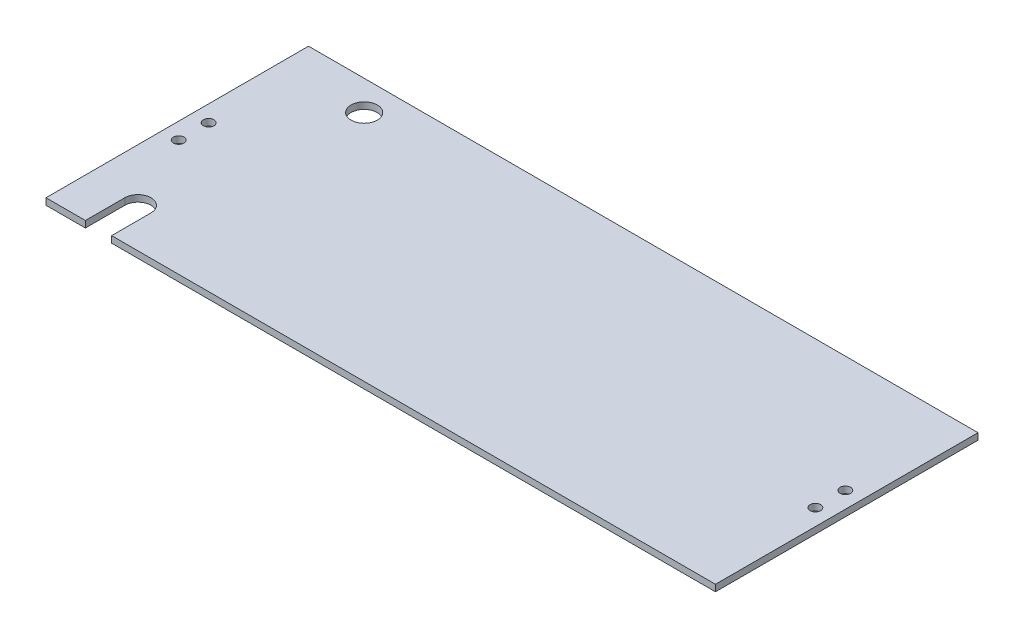
ISO-10303-21;
HEADER;
FILE_DESCRIPTION(('STEP AP214'),'2;1');
FILE_NAME('part.step','',(''),(''),'','','');
FILE_SCHEMA(('AUTOMOTIVE_DESIGN { 1 0 10303 214 1 1 1 1 }'));
ENDSEC;
DATA;
#1=APPLICATION_CONTEXT('core data for automotive mechanical design processes');
#2=APPLICATION_PROTOCOL_DEFINITION('international standard','automotive_design',2000,#1);
#3=PRODUCT_CONTEXT('',#1,'mechanical');
#4=PRODUCT('Part','Part','',(#3));
#5=PRODUCT_RELATED_PRODUCT_CATEGORY('part','',(#4));
#6=PRODUCT_DEFINITION_FORMATION('','',#4);
#7=PRODUCT_DEFINITION_CONTEXT('part definition',#1,'design');
#8=PRODUCT_DEFINITION('design','',#6,#7);
#9=PRODUCT_DEFINITION_SHAPE('','',#8);
#10=(LENGTH_UNIT() NAMED_UNIT(*) SI_UNIT(.MILLI.,.METRE.));
#11=(NAMED_UNIT(*) PLANE_ANGLE_UNIT() SI_UNIT($,.RADIAN.));
#12=(NAMED_UNIT(*) SI_UNIT($,.STERADIAN.) SOLID_ANGLE_UNIT());
#13=UNCERTAINTY_MEASURE_WITH_UNIT(LENGTH_MEASURE(1.E-05),#10,'distance_accuracy_value','');
#14=(GEOMETRIC_REPRESENTATION_CONTEXT(3) GLOBAL_UNCERTAINTY_ASSIGNED_CONTEXT((#13)) GLOBAL_UNIT_ASSIGNED_CONTEXT((#10,
#11,#12)) REPRESENTATION_CONTEXT('',''));
#15=CARTESIAN_POINT('',(0.,0.,0.));
#16=DIRECTION('',(0.,0.,1.));
#17=DIRECTION('',(1.,0.,0.));
#18=AXIS2_PLACEMENT_3D('',#15,#16,#17);
#19=CARTESIAN_POINT('',(0.,3.175,0.));
#20=DIRECTION('',(0.,0.,-1.));
#21=DIRECTION('',(-1.,0.,0.));
#22=AXIS2_PLACEMENT_3D('',#19,#20,#21);
#23=PLANE('',#22);
#24=DIRECTION('',(0.,-1.,0.));
#25=VECTOR('',#24,1.);
#26=CARTESIAN_POINT('',(19.05,3.175,0.));
#27=LINE('',#26,#25);
#28=CARTESIAN_POINT('',(19.05,3.175,0.));
#29=VERTEX_POINT('',#28);
#30=CARTESIAN_POINT('',(19.05,0.,0.));
#31=VERTEX_POINT('',#30);
#32=EDGE_CURVE('E48',#29,#31,#27,.T.);
#33=ORIENTED_EDGE('',*,*,#32,.F.);
#34=DIRECTION('',(1.,0.,0.));
#35=VECTOR('',#34,1.);
#36=CARTESIAN_POINT('',(0.,3.175,0.));
#37=LINE('',#36,#35);
#38=CARTESIAN_POINT('',(0.,3.175,0.));
#39=VERTEX_POINT('',#38);
#40=EDGE_CURVE('E84',#39,#29,#37,.T.);
#41=ORIENTED_EDGE('',*,*,#40,.F.);
#42=DIRECTION('',(0.,-1.,0.));
#43=VECTOR('',#42,1.);
#44=CARTESIAN_POINT('',(0.,3.175,0.));
#45=LINE('',#44,#43);
#46=CARTESIAN_POINT('',(0.,0.,0.));
#47=VERTEX_POINT('',#46);
#48=EDGE_CURVE('E11',#39,#47,#45,.T.);
#49=ORIENTED_EDGE('',*,*,#48,.T.);
#50=DIRECTION('',(1.,0.,0.));
#51=VECTOR('',#50,1.);
#52=CARTESIAN_POINT('',(0.,0.,0.));
#53=LINE('',#52,#51);
#54=EDGE_CURVE('E145',#47,#31,#53,.T.);
#55=ORIENTED_EDGE('',*,*,#54,.T.);
#56=EDGE_LOOP('',(#33,#41,#49,#55));
#57=FACE_BOUND('',#56,.T.);
#58=ADVANCED_FACE('F33',(#57),#23,.F.);
#59=CARTESIAN_POINT('',(0.,3.175,0.));
#60=DIRECTION('',(1.,0.,0.));
#61=DIRECTION('',(0.,0.,-1.));
#62=AXIS2_PLACEMENT_3D('',#59,#60,#61);
#63=PLANE('',#62);
#64=DIRECTION('',(0.,0.,1.));
#65=VECTOR('',#64,1.);
#66=CARTESIAN_POINT('',(0.,0.,0.));
#67=LINE('',#66,#65);
#68=CARTESIAN_POINT('',(0.,0.,-127.));
#69=VERTEX_POINT('',#68);
#70=EDGE_CURVE('E140',#69,#47,#67,.T.);
#71=ORIENTED_EDGE('',*,*,#70,.T.);
#72=ORIENTED_EDGE('',*,*,#48,.F.);
#73=DIRECTION('',(0.,0.,1.));
#74=VECTOR('',#73,1.);
#75=CARTESIAN_POINT('',(0.,3.175,0.));
#76=LINE('',#75,#74);
#77=CARTESIAN_POINT('',(0.,3.175,-127.));
#78=VERTEX_POINT('',#77);
#79=EDGE_CURVE('E131',#78,#39,#76,.T.);
#80=ORIENTED_EDGE('',*,*,#79,.F.);
#81=DIRECTION('',(0.,-1.,0.));
#82=VECTOR('',#81,1.);
#83=CARTESIAN_POINT('',(0.,3.175,-127.));
#84=LINE('',#83,#82);
#85=EDGE_CURVE('E139',#78,#69,#84,.T.);
#86=ORIENTED_EDGE('',*,*,#85,.T.);
#87=EDGE_LOOP('',(#71,#72,#80,#86));
#88=FACE_BOUND('',#87,.T.);
#89=ADVANCED_FACE('F35',(#88),#63,.F.);
#90=CARTESIAN_POINT('',(31.75,3.175,0.));
#91=VERTEX_POINT('',#90);
#92=CARTESIAN_POINT('',(323.85,3.175,0.));
#93=VERTEX_POINT('',#92);
#94=EDGE_CURVE('E121',#91,#93,#37,.T.);
#95=ORIENTED_EDGE('',*,*,#94,.F.);
#96=DIRECTION('',(0.,-1.,0.));
#97=VECTOR('',#96,1.);
#98=CARTESIAN_POINT('',(31.75,3.175,0.));
#99=LINE('',#98,#97);
#100=CARTESIAN_POINT('',(31.75,0.,0.));
#101=VERTEX_POINT('',#100);
#102=EDGE_CURVE('E108',#91,#101,#99,.T.);
#103=ORIENTED_EDGE('',*,*,#102,.T.);
#104=CARTESIAN_POINT('',(323.85,0.,0.));
#105=VERTEX_POINT('',#104);
#106=EDGE_CURVE('E143',#101,#105,#53,.T.);
#107=ORIENTED_EDGE('',*,*,#106,.T.);
#108=DIRECTION('',(0.,-1.,0.));
#109=VECTOR('',#108,1.);
#110=CARTESIAN_POINT('',(323.85,3.175,0.));
#111=LINE('',#110,#109);
#112=EDGE_CURVE('E41',#93,#105,#111,.T.);
#113=ORIENTED_EDGE('',*,*,#112,.F.);
#114=EDGE_LOOP('',(#95,#103,#107,#113));
#115=FACE_BOUND('',#114,.T.);
#116=ADVANCED_FACE('F128',(#115),#23,.F.);
#117=CARTESIAN_POINT('',(323.85,3.175,0.));
#118=DIRECTION('',(-1.,0.,0.));
#119=DIRECTION('',(0.,0.,1.));
#120=AXIS2_PLACEMENT_3D('',#117,#118,#119);
#121=PLANE('',#120);
#122=DIRECTION('',(0.,0.,-1.));
#123=VECTOR('',#122,1.);
#124=CARTESIAN_POINT('',(323.85,0.,0.));
#125=LINE('',#124,#123);
#126=CARTESIAN_POINT('',(323.85,0.,-127.));
#127=VERTEX_POINT('',#126);
#128=EDGE_CURVE('E148',#105,#127,#125,.T.);
#129=ORIENTED_EDGE('',*,*,#128,.T.);
#130=DIRECTION('',(0.,-1.,0.));
#131=VECTOR('',#130,1.);
#132=CARTESIAN_POINT('',(323.85,3.175,-127.));
#133=LINE('',#132,#131);
#134=CARTESIAN_POINT('',(323.85,3.175,-127.));
#135=VERTEX_POINT('',#134);
#136=EDGE_CURVE('E152',#135,#127,#133,.T.);
#137=ORIENTED_EDGE('',*,*,#136,.F.);
#138=DIRECTION('',(0.,0.,-1.));
#139=VECTOR('',#138,1.);
#140=CARTESIAN_POINT('',(323.85,3.175,0.));
#141=LINE('',#140,#139);
#142=EDGE_CURVE('E133',#93,#135,#141,.T.);
#143=ORIENTED_EDGE('',*,*,#142,.F.);
#144=ORIENTED_EDGE('',*,*,#112,.T.);
#145=EDGE_LOOP('',(#129,#137,#143,#144));
#146=FACE_BOUND('',#145,.T.);
#147=ADVANCED_FACE('F155',(#146),#121,.F.);
#148=CARTESIAN_POINT('',(0.,3.175,-127.));
#149=DIRECTION('',(0.,0.,1.));
#150=DIRECTION('',(1.,0.,0.));
#151=AXIS2_PLACEMENT_3D('',#148,#149,#150);
#152=PLANE('',#151);
#153=DIRECTION('',(-1.,0.,0.));
#154=VECTOR('',#153,1.);
#155=CARTESIAN_POINT('',(0.,0.,-127.));
#156=LINE('',#155,#154);
#157=EDGE_CURVE('E78',#127,#69,#156,.T.);
#158=ORIENTED_EDGE('',*,*,#157,.T.);
#159=ORIENTED_EDGE('',*,*,#85,.F.);
#160=DIRECTION('',(-1.,0.,0.));
#161=VECTOR('',#160,1.);
#162=CARTESIAN_POINT('',(0.,3.175,-127.));
#163=LINE('',#162,#161);
#164=EDGE_CURVE('E57',#135,#78,#163,.T.);
#165=ORIENTED_EDGE('',*,*,#164,.F.);
#166=ORIENTED_EDGE('',*,*,#136,.T.);
#167=EDGE_LOOP('',(#158,#159,#165,#166));
#168=FACE_BOUND('',#167,.T.);
#169=ADVANCED_FACE('F164',(#168),#152,.F.);
#170=CARTESIAN_POINT('',(0.,3.175,0.));
#171=DIRECTION('',(0.,-1.,0.));
#172=DIRECTION('',(0.,0.,-1.));
#173=AXIS2_PLACEMENT_3D('',#170,#171,#172);
#174=PLANE('',#173);
#175=CARTESIAN_POINT('',(315.9125,3.175,-70.7500000000001));
#176=DIRECTION('',(0.,-1.,0.));
#177=DIRECTION('',(0.,0.,-1.));
#178=AXIS2_PLACEMENT_3D('',#175,#176,#177);
#179=CIRCLE('',#178,2.55269999999996);
#180=CARTESIAN_POINT('',(315.9125,3.175,-73.3027));
#181=VERTEX_POINT('',#180);
#182=EDGE_CURVE('E342',#181,#181,#179,.T.);
#183=ORIENTED_EDGE('',*,*,#182,.T.);
#184=EDGE_LOOP('',(#183));
#185=FACE_BOUND('',#184,.T.);
#186=CARTESIAN_POINT('',(315.9125,3.175,-56.2500000000001));
#187=DIRECTION('',(0.,-1.,0.));
#188=DIRECTION('',(0.,0.,-1.));
#189=AXIS2_PLACEMENT_3D('',#186,#187,#188);
#190=CIRCLE('',#189,2.55269999999996);
#191=CARTESIAN_POINT('',(315.9125,3.175,-58.8027));
#192=VERTEX_POINT('',#191);
#193=EDGE_CURVE('E338',#192,#192,#190,.T.);
#194=ORIENTED_EDGE('',*,*,#193,.T.);
#195=EDGE_LOOP('',(#194));
#196=FACE_BOUND('',#195,.T.);
#197=CARTESIAN_POINT('',(7.93749999999982,3.175,-70.75));
#198=DIRECTION('',(0.,-1.,0.));
#199=DIRECTION('',(0.,0.,-1.));
#200=AXIS2_PLACEMENT_3D('',#197,#198,#199);
#201=CIRCLE('',#200,2.55269999999999);
#202=CARTESIAN_POINT('',(7.93749999999982,3.175,-73.3027));
#203=VERTEX_POINT('',#202);
#204=EDGE_CURVE('E309',#203,#203,#201,.T.);
#205=ORIENTED_EDGE('',*,*,#204,.T.);
#206=EDGE_LOOP('',(#205));
#207=FACE_BOUND('',#206,.T.);
#208=CARTESIAN_POINT('',(7.93749999999982,3.175,-56.25));
#209=DIRECTION('',(0.,-1.,0.));
#210=DIRECTION('',(0.,0.,-1.));
#211=AXIS2_PLACEMENT_3D('',#208,#209,#210);
#212=CIRCLE('',#211,2.55269999999999);
#213=CARTESIAN_POINT('',(7.93749999999982,3.175,-58.8027));
#214=VERTEX_POINT('',#213);
#215=EDGE_CURVE('E308',#214,#214,#212,.T.);
#216=ORIENTED_EDGE('',*,*,#215,.T.);
#217=EDGE_LOOP('',(#216));
#218=FACE_BOUND('',#217,.T.);
#219=CARTESIAN_POINT('',(41.2749999999999,3.175,-112.649));
#220=DIRECTION('',(0.,-1.,0.));
#221=DIRECTION('',(0.,0.,-1.));
#222=AXIS2_PLACEMENT_3D('',#219,#220,#221);
#223=CIRCLE('',#222,6.35);
#224=CARTESIAN_POINT('',(41.2749999999999,3.175,-118.999));
#225=VERTEX_POINT('',#224);
#226=EDGE_CURVE('E144',#225,#225,#223,.T.);
#227=ORIENTED_EDGE('',*,*,#226,.T.);
#228=EDGE_LOOP('',(#227));
#229=FACE_BOUND('',#228,.T.);
#230=CARTESIAN_POINT('',(25.4,3.175,-19.0500000000013));
#231=DIRECTION('',(0.,-1.,0.));
#232=DIRECTION('',(0.,0.,-1.));
#233=AXIS2_PLACEMENT_3D('',#230,#231,#232);
#234=CIRCLE('',#233,6.35);
#235=CARTESIAN_POINT('',(19.05,3.175,-19.0500000000013));
#236=VERTEX_POINT('',#235);
#237=CARTESIAN_POINT('',(31.75,3.175,-19.0500000000013));
#238=VERTEX_POINT('',#237);
#239=EDGE_CURVE('E118',#236,#238,#234,.T.);
#240=ORIENTED_EDGE('',*,*,#239,.T.);
#241=DIRECTION('',(0.,0.,1.));
#242=VECTOR('',#241,1.);
#243=CARTESIAN_POINT('',(31.75,3.175,0.));
#244=LINE('',#243,#242);
#245=EDGE_CURVE('E111',#238,#91,#244,.T.);
#246=ORIENTED_EDGE('',*,*,#245,.T.);
#247=ORIENTED_EDGE('',*,*,#94,.T.);
#248=ORIENTED_EDGE('',*,*,#142,.T.);
#249=ORIENTED_EDGE('',*,*,#164,.T.);
#250=ORIENTED_EDGE('',*,*,#79,.T.);
#251=ORIENTED_EDGE('',*,*,#40,.T.);
#252=DIRECTION('',(0.,0.,1.));
#253=VECTOR('',#252,1.);
#254=CARTESIAN_POINT('',(19.05,3.175,0.));
#255=LINE('',#254,#253);
#256=EDGE_CURVE('E125',#236,#29,#255,.T.);
#257=ORIENTED_EDGE('',*,*,#256,.F.);
#258=EDGE_LOOP('',(#240,#246,#247,#248,#249,#250,#251,#257));
#259=FACE_BOUND('',#258,.T.);
#260=ADVANCED_FACE('F120',(#185,#196,#207,#218,#229,#259),#174,.F.);
#261=CARTESIAN_POINT('',(0.,0.,0.));
#262=DIRECTION('',(0.,-1.,0.));
#263=DIRECTION('',(0.,0.,-1.));
#264=AXIS2_PLACEMENT_3D('',#261,#262,#263);
#265=PLANE('',#264);
#266=CARTESIAN_POINT('',(315.9125,0.,-70.7500000000001));
#267=DIRECTION('',(0.,-1.,0.));
#268=DIRECTION('',(0.,0.,-1.));
#269=AXIS2_PLACEMENT_3D('',#266,#267,#268);
#270=CIRCLE('',#269,2.55269999999996);
#271=CARTESIAN_POINT('',(315.9125,0.,-73.3027));
#272=VERTEX_POINT('',#271);
#273=EDGE_CURVE('E296',#272,#272,#270,.T.);
#274=ORIENTED_EDGE('',*,*,#273,.F.);
#275=EDGE_LOOP('',(#274));
#276=FACE_BOUND('',#275,.T.);
#277=CARTESIAN_POINT('',(315.9125,0.,-56.2500000000001));
#278=DIRECTION('',(0.,-1.,0.));
#279=DIRECTION('',(0.,0.,-1.));
#280=AXIS2_PLACEMENT_3D('',#277,#278,#279);
#281=CIRCLE('',#280,2.55269999999996);
#282=CARTESIAN_POINT('',(315.9125,0.,-58.8027));
#283=VERTEX_POINT('',#282);
#284=EDGE_CURVE('E300',#283,#283,#281,.T.);
#285=ORIENTED_EDGE('',*,*,#284,.F.);
#286=EDGE_LOOP('',(#285));
#287=FACE_BOUND('',#286,.T.);
#288=CARTESIAN_POINT('',(7.93749999999982,0.,-70.75));
#289=DIRECTION('',(0.,-1.,0.));
#290=DIRECTION('',(0.,0.,-1.));
#291=AXIS2_PLACEMENT_3D('',#288,#289,#290);
#292=CIRCLE('',#291,2.55269999999999);
#293=CARTESIAN_POINT('',(7.93749999999982,0.,-73.3027));
#294=VERTEX_POINT('',#293);
#295=EDGE_CURVE('E304',#294,#294,#292,.T.);
#296=ORIENTED_EDGE('',*,*,#295,.F.);
#297=EDGE_LOOP('',(#296));
#298=FACE_BOUND('',#297,.T.);
#299=CARTESIAN_POINT('',(7.93749999999982,0.,-56.25));
#300=DIRECTION('',(0.,-1.,0.));
#301=DIRECTION('',(0.,0.,-1.));
#302=AXIS2_PLACEMENT_3D('',#299,#300,#301);
#303=CIRCLE('',#302,2.55269999999999);
#304=CARTESIAN_POINT('',(7.93749999999982,0.,-58.8027));
#305=VERTEX_POINT('',#304);
#306=EDGE_CURVE('E307',#305,#305,#303,.T.);
#307=ORIENTED_EDGE('',*,*,#306,.F.);
#308=EDGE_LOOP('',(#307));
#309=FACE_BOUND('',#308,.T.);
#310=DIRECTION('',(0.,0.,1.));
#311=VECTOR('',#310,1.);
#312=CARTESIAN_POINT('',(31.75,0.,0.));
#313=LINE('',#312,#311);
#314=CARTESIAN_POINT('',(31.75,0.,-19.0500000000013));
#315=VERTEX_POINT('',#314);
#316=EDGE_CURVE('E114',#315,#101,#313,.T.);
#317=ORIENTED_EDGE('',*,*,#316,.F.);
#318=CARTESIAN_POINT('',(25.4,0.,-19.0500000000013));
#319=DIRECTION('',(0.,-1.,0.));
#320=DIRECTION('',(0.,0.,-1.));
#321=AXIS2_PLACEMENT_3D('',#318,#319,#320);
#322=CIRCLE('',#321,6.35);
#323=CARTESIAN_POINT('',(19.05,0.,-19.0500000000013));
#324=VERTEX_POINT('',#323);
#325=EDGE_CURVE('E126',#324,#315,#322,.T.);
#326=ORIENTED_EDGE('',*,*,#325,.F.);
#327=DIRECTION('',(0.,0.,1.));
#328=VECTOR('',#327,1.);
#329=CARTESIAN_POINT('',(19.05,0.,0.));
#330=LINE('',#329,#328);
#331=EDGE_CURVE('E320',#324,#31,#330,.T.);
#332=ORIENTED_EDGE('',*,*,#331,.T.);
#333=ORIENTED_EDGE('',*,*,#54,.F.);
#334=ORIENTED_EDGE('',*,*,#70,.F.);
#335=ORIENTED_EDGE('',*,*,#157,.F.);
#336=ORIENTED_EDGE('',*,*,#128,.F.);
#337=ORIENTED_EDGE('',*,*,#106,.F.);
#338=EDGE_LOOP('',(#317,#326,#332,#333,#334,#335,#336,#337));
#339=FACE_BOUND('',#338,.T.);
#340=CARTESIAN_POINT('',(41.2749999999999,0.,-112.649));
#341=DIRECTION('',(0.,-1.,0.));
#342=DIRECTION('',(0.,0.,-1.));
#343=AXIS2_PLACEMENT_3D('',#340,#341,#342);
#344=CIRCLE('',#343,6.35);
#345=CARTESIAN_POINT('',(41.2749999999999,0.,-118.999));
#346=VERTEX_POINT('',#345);
#347=EDGE_CURVE('E326',#346,#346,#344,.T.);
#348=ORIENTED_EDGE('',*,*,#347,.F.);
#349=EDGE_LOOP('',(#348));
#350=FACE_BOUND('',#349,.T.);
#351=ADVANCED_FACE('F158',(#276,#287,#298,#309,#339,#350),#265,.T.);
#352=CARTESIAN_POINT('',(41.2749999999999,3.175,-112.649));
#353=DIRECTION('',(0.,-1.,0.));
#354=DIRECTION('',(0.,0.,-1.));
#355=AXIS2_PLACEMENT_3D('',#352,#353,#354);
#356=CYLINDRICAL_SURFACE('',#355,6.35);
#357=ORIENTED_EDGE('',*,*,#226,.F.);
#358=EDGE_LOOP('',(#357));
#359=FACE_BOUND('',#358,.T.);
#360=ORIENTED_EDGE('',*,*,#347,.T.);
#361=EDGE_LOOP('',(#360));
#362=FACE_BOUND('',#361,.T.);
#363=ADVANCED_FACE('F209',(#359,#362),#356,.F.);
#364=CARTESIAN_POINT('',(31.75,3.175,0.));
#365=DIRECTION('',(1.,0.,0.));
#366=DIRECTION('',(0.,0.,-1.));
#367=AXIS2_PLACEMENT_3D('',#364,#365,#366);
#368=PLANE('',#367);
#369=ORIENTED_EDGE('',*,*,#316,.T.);
#370=ORIENTED_EDGE('',*,*,#102,.F.);
#371=ORIENTED_EDGE('',*,*,#245,.F.);
#372=DIRECTION('',(0.,-1.,0.));
#373=VECTOR('',#372,1.);
#374=CARTESIAN_POINT('',(31.75,3.175,-19.0500000000013));
#375=LINE('',#374,#373);
#376=EDGE_CURVE('E324',#238,#315,#375,.T.);
#377=ORIENTED_EDGE('',*,*,#376,.T.);
#378=EDGE_LOOP('',(#369,#370,#371,#377));
#379=FACE_BOUND('',#378,.T.);
#380=ADVANCED_FACE('F110',(#379),#368,.F.);
#381=CARTESIAN_POINT('',(25.4,3.175,-19.0500000000013));
#382=DIRECTION('',(0.,-1.,0.));
#383=DIRECTION('',(0.,0.,-1.));
#384=AXIS2_PLACEMENT_3D('',#381,#382,#383);
#385=CYLINDRICAL_SURFACE('',#384,6.35);
#386=ORIENTED_EDGE('',*,*,#325,.T.);
#387=ORIENTED_EDGE('',*,*,#376,.F.);
#388=ORIENTED_EDGE('',*,*,#239,.F.);
#389=DIRECTION('',(0.,-1.,0.));
#390=VECTOR('',#389,1.);
#391=CARTESIAN_POINT('',(19.05,3.175,-19.0500000000013));
#392=LINE('',#391,#390);
#393=EDGE_CURVE('E327',#236,#324,#392,.T.);
#394=ORIENTED_EDGE('',*,*,#393,.T.);
#395=EDGE_LOOP('',(#386,#387,#388,#394));
#396=FACE_BOUND('',#395,.T.);
#397=ADVANCED_FACE('F222',(#396),#385,.F.);
#398=CARTESIAN_POINT('',(19.05,3.175,0.));
#399=DIRECTION('',(1.,0.,0.));
#400=DIRECTION('',(0.,0.,-1.));
#401=AXIS2_PLACEMENT_3D('',#398,#399,#400);
#402=PLANE('',#401);
#403=ORIENTED_EDGE('',*,*,#331,.F.);
#404=ORIENTED_EDGE('',*,*,#393,.F.);
#405=ORIENTED_EDGE('',*,*,#256,.T.);
#406=ORIENTED_EDGE('',*,*,#32,.T.);
#407=EDGE_LOOP('',(#403,#404,#405,#406));
#408=FACE_BOUND('',#407,.T.);
#409=ADVANCED_FACE('F230',(#408),#402,.T.);
#410=CARTESIAN_POINT('',(7.93749999999982,0.,-56.25));
#411=DIRECTION('',(0.,-1.,0.));
#412=DIRECTION('',(0.,0.,-1.));
#413=AXIS2_PLACEMENT_3D('',#410,#411,#412);
#414=CYLINDRICAL_SURFACE('',#413,2.55269999999999);
#415=ORIENTED_EDGE('',*,*,#306,.T.);
#416=EDGE_LOOP('',(#415));
#417=FACE_BOUND('',#416,.T.);
#418=ORIENTED_EDGE('',*,*,#215,.F.);
#419=EDGE_LOOP('',(#418));
#420=FACE_BOUND('',#419,.T.);
#421=ADVANCED_FACE('F239',(#417,#420),#414,.F.);
#422=CARTESIAN_POINT('',(7.93749999999982,0.,-70.75));
#423=DIRECTION('',(0.,-1.,0.));
#424=DIRECTION('',(0.,0.,-1.));
#425=AXIS2_PLACEMENT_3D('',#422,#423,#424);
#426=CYLINDRICAL_SURFACE('',#425,2.55269999999999);
#427=ORIENTED_EDGE('',*,*,#295,.T.);
#428=EDGE_LOOP('',(#427));
#429=FACE_BOUND('',#428,.T.);
#430=ORIENTED_EDGE('',*,*,#204,.F.);
#431=EDGE_LOOP('',(#430));
#432=FACE_BOUND('',#431,.T.);
#433=ADVANCED_FACE('F248',(#429,#432),#426,.F.);
#434=CARTESIAN_POINT('',(315.9125,0.,-56.2500000000001));
#435=DIRECTION('',(0.,-1.,0.));
#436=DIRECTION('',(0.,0.,-1.));
#437=AXIS2_PLACEMENT_3D('',#434,#435,#436);
#438=CYLINDRICAL_SURFACE('',#437,2.55269999999996);
#439=ORIENTED_EDGE('',*,*,#284,.T.);
#440=EDGE_LOOP('',(#439));
#441=FACE_BOUND('',#440,.T.);
#442=ORIENTED_EDGE('',*,*,#193,.F.);
#443=EDGE_LOOP('',(#442));
#444=FACE_BOUND('',#443,.T.);
#445=ADVANCED_FACE('F257',(#441,#444),#438,.F.);
#446=CARTESIAN_POINT('',(315.9125,0.,-70.7500000000001));
#447=DIRECTION('',(0.,-1.,0.));
#448=DIRECTION('',(0.,0.,-1.));
#449=AXIS2_PLACEMENT_3D('',#446,#447,#448);
#450=CYLINDRICAL_SURFACE('',#449,2.55269999999996);
#451=ORIENTED_EDGE('',*,*,#273,.T.);
#452=EDGE_LOOP('',(#451));
#453=FACE_BOUND('',#452,.T.);
#454=ORIENTED_EDGE('',*,*,#182,.F.);
#455=EDGE_LOOP('',(#454));
#456=FACE_BOUND('',#455,.T.);
#457=ADVANCED_FACE('F266',(#453,#456),#450,.F.);
#458=CLOSED_SHELL('',(#58,#89,#116,#147,#169,#260,#351,#363,#380,#397,#409,#421,#433,#445,#457));
#459=MANIFOLD_SOLID_BREP('B2',#458);
#460=ADVANCED_BREP_SHAPE_REPRESENTATION('',(#18,#459),#14);
#461=SHAPE_DEFINITION_REPRESENTATION(#9,#460);
ENDSEC;
END-ISO-10303-21;
